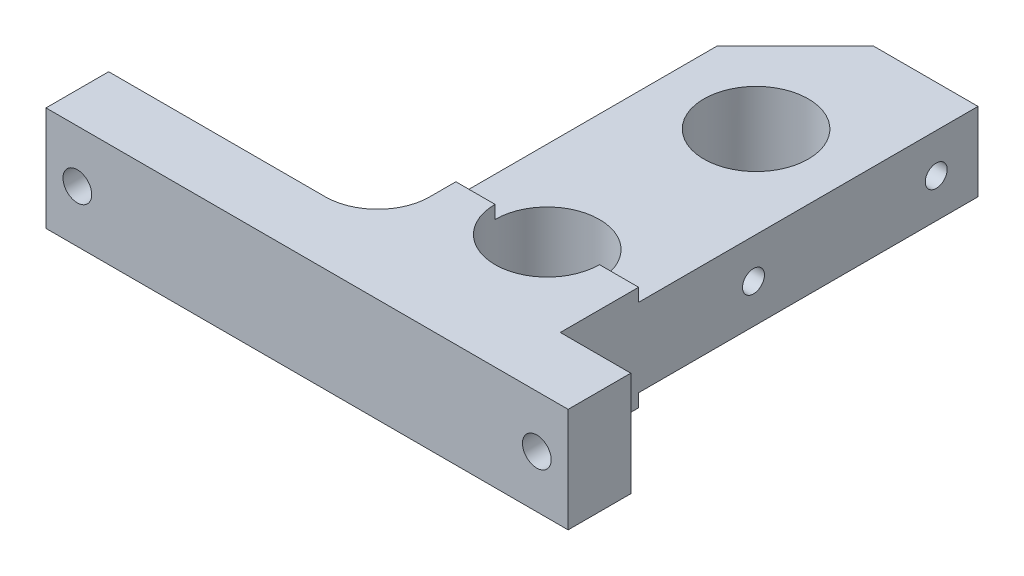
ISO-10303-21;
HEADER;
FILE_DESCRIPTION(('STEP AP214'),'2;1');
FILE_NAME('part.step','',(''),(''),'','','');
FILE_SCHEMA(('AUTOMOTIVE_DESIGN { 1 0 10303 214 1 1 1 1 }'));
ENDSEC;
DATA;
#1=APPLICATION_CONTEXT('core data for automotive mechanical design processes');
#2=APPLICATION_PROTOCOL_DEFINITION('international standard','automotive_design',2000,#1);
#3=PRODUCT_CONTEXT('',#1,'mechanical');
#4=PRODUCT('Part','Part','',(#3));
#5=PRODUCT_RELATED_PRODUCT_CATEGORY('part','',(#4));
#6=PRODUCT_DEFINITION_FORMATION('','',#4);
#7=PRODUCT_DEFINITION_CONTEXT('part definition',#1,'design');
#8=PRODUCT_DEFINITION('design','',#6,#7);
#9=PRODUCT_DEFINITION_SHAPE('','',#8);
#10=(LENGTH_UNIT() NAMED_UNIT(*) SI_UNIT(.MILLI.,.METRE.));
#11=(NAMED_UNIT(*) PLANE_ANGLE_UNIT() SI_UNIT($,.RADIAN.));
#12=(NAMED_UNIT(*) SI_UNIT($,.STERADIAN.) SOLID_ANGLE_UNIT());
#13=UNCERTAINTY_MEASURE_WITH_UNIT(LENGTH_MEASURE(1.E-05),#10,'distance_accuracy_value','');
#14=(GEOMETRIC_REPRESENTATION_CONTEXT(3) GLOBAL_UNCERTAINTY_ASSIGNED_CONTEXT((#13)) GLOBAL_UNIT_ASSIGNED_CONTEXT((#10,
#11,#12)) REPRESENTATION_CONTEXT('',''));
#15=CARTESIAN_POINT('',(0.,0.,0.));
#16=DIRECTION('',(0.,0.,1.));
#17=DIRECTION('',(1.,0.,0.));
#18=AXIS2_PLACEMENT_3D('',#15,#16,#17);
#19=CARTESIAN_POINT('',(0.,0.,-15.));
#20=DIRECTION('',(0.,0.,-1.));
#21=DIRECTION('',(-1.,0.,0.));
#22=AXIS2_PLACEMENT_3D('',#19,#20,#21);
#23=PLANE('',#22);
#24=DIRECTION('',(-1.,0.,0.));
#25=VECTOR('',#24,1.);
#26=CARTESIAN_POINT('',(1.50000000000001,-10.,-15.));
#27=LINE('',#26,#25);
#28=CARTESIAN_POINT('',(36.5,-10.,-15.));
#29=VERTEX_POINT('',#28);
#30=CARTESIAN_POINT('',(29.,-9.99999999999999,-15.));
#31=VERTEX_POINT('',#30);
#32=EDGE_CURVE('E238',#29,#31,#27,.T.);
#33=ORIENTED_EDGE('',*,*,#32,.T.);
#34=DIRECTION('',(0.,-1.,0.));
#35=VECTOR('',#34,1.);
#36=CARTESIAN_POINT('',(29.,72.5,-15.));
#37=LINE('',#36,#35);
#38=CARTESIAN_POINT('',(29.,-7.50000000000001,-15.));
#39=VERTEX_POINT('',#38);
#40=EDGE_CURVE('E193',#31,#39,#37,.F.);
#41=ORIENTED_EDGE('',*,*,#40,.T.);
#42=DIRECTION('',(-1.,0.,0.));
#43=VECTOR('',#42,1.);
#44=CARTESIAN_POINT('',(1.50000000000001,-7.5,-15.));
#45=LINE('',#44,#43);
#46=CARTESIAN_POINT('',(36.5,-7.50000000000001,-15.));
#47=VERTEX_POINT('',#46);
#48=EDGE_CURVE('E210',#47,#39,#45,.T.);
#49=ORIENTED_EDGE('',*,*,#48,.F.);
#50=DIRECTION('',(0.,-1.,0.));
#51=VECTOR('',#50,1.);
#52=CARTESIAN_POINT('',(36.5,-10.,-15.));
#53=LINE('',#52,#51);
#54=EDGE_CURVE('E237',#47,#29,#53,.T.);
#55=ORIENTED_EDGE('',*,*,#54,.T.);
#56=EDGE_LOOP('',(#33,#41,#49,#55));
#57=FACE_BOUND('',#56,.T.);
#58=ADVANCED_FACE('F35',(#57),#23,.T.);
#59=CARTESIAN_POINT('',(9.00000000000001,-7.50000000000001,-15.));
#60=VERTEX_POINT('',#59);
#61=CARTESIAN_POINT('',(1.50000000000001,-7.50000000000001,-15.));
#62=VERTEX_POINT('',#61);
#63=EDGE_CURVE('E219',#60,#62,#45,.T.);
#64=ORIENTED_EDGE('',*,*,#63,.F.);
#65=DIRECTION('',(0.,-1.,0.));
#66=VECTOR('',#65,1.);
#67=CARTESIAN_POINT('',(9.00000000000001,72.5,-15.));
#68=LINE('',#67,#66);
#69=CARTESIAN_POINT('',(9.00000000000001,-9.99999999999999,-15.));
#70=VERTEX_POINT('',#69);
#71=EDGE_CURVE('E59',#60,#70,#68,.T.);
#72=ORIENTED_EDGE('',*,*,#71,.T.);
#73=CARTESIAN_POINT('',(1.50000000000001,-10.,-15.));
#74=VERTEX_POINT('',#73);
#75=EDGE_CURVE('E236',#70,#74,#27,.T.);
#76=ORIENTED_EDGE('',*,*,#75,.T.);
#77=DIRECTION('',(0.,1.,0.));
#78=VECTOR('',#77,1.);
#79=CARTESIAN_POINT('',(1.50000000000001,-10.,-15.));
#80=LINE('',#79,#78);
#81=EDGE_CURVE('E242',#74,#62,#80,.T.);
#82=ORIENTED_EDGE('',*,*,#81,.T.);
#83=EDGE_LOOP('',(#64,#72,#76,#82));
#84=FACE_BOUND('',#83,.T.);
#85=ADVANCED_FACE('F379',(#84),#23,.T.);
#86=DIRECTION('',(1.,0.,0.));
#87=VECTOR('',#86,1.);
#88=CARTESIAN_POINT('',(1.50000000000001,7.5,-15.));
#89=LINE('',#88,#87);
#90=CARTESIAN_POINT('',(29.,7.50000000000001,-15.));
#91=VERTEX_POINT('',#90);
#92=CARTESIAN_POINT('',(36.5,7.5,-15.));
#93=VERTEX_POINT('',#92);
#94=EDGE_CURVE('E206',#91,#93,#89,.T.);
#95=ORIENTED_EDGE('',*,*,#94,.F.);
#96=DIRECTION('',(0.,-1.,0.));
#97=VECTOR('',#96,1.);
#98=CARTESIAN_POINT('',(29.,72.5,-15.));
#99=LINE('',#98,#97);
#100=CARTESIAN_POINT('',(29.,10.,-15.));
#101=VERTEX_POINT('',#100);
#102=EDGE_CURVE('E52',#91,#101,#99,.F.);
#103=ORIENTED_EDGE('',*,*,#102,.T.);
#104=DIRECTION('',(1.,0.,0.));
#105=VECTOR('',#104,1.);
#106=CARTESIAN_POINT('',(1.50000000000001,10.,-15.));
#107=LINE('',#106,#105);
#108=CARTESIAN_POINT('',(36.5,10.,-15.));
#109=VERTEX_POINT('',#108);
#110=EDGE_CURVE('E245',#101,#109,#107,.T.);
#111=ORIENTED_EDGE('',*,*,#110,.T.);
#112=EDGE_CURVE('E233',#109,#93,#53,.T.);
#113=ORIENTED_EDGE('',*,*,#112,.T.);
#114=EDGE_LOOP('',(#95,#103,#111,#113));
#115=FACE_BOUND('',#114,.T.);
#116=ADVANCED_FACE('F351',(#115),#23,.T.);
#117=CARTESIAN_POINT('',(1.50000000000001,10.,-15.));
#118=VERTEX_POINT('',#117);
#119=CARTESIAN_POINT('',(9.00000000000001,10.,-15.));
#120=VERTEX_POINT('',#119);
#121=EDGE_CURVE('E246',#118,#120,#107,.T.);
#122=ORIENTED_EDGE('',*,*,#121,.T.);
#123=DIRECTION('',(0.,-1.,0.));
#124=VECTOR('',#123,1.);
#125=CARTESIAN_POINT('',(9.00000000000001,72.5,-15.));
#126=LINE('',#125,#124);
#127=CARTESIAN_POINT('',(9.00000000000001,7.50000000000001,-15.));
#128=VERTEX_POINT('',#127);
#129=EDGE_CURVE('E200',#120,#128,#126,.T.);
#130=ORIENTED_EDGE('',*,*,#129,.T.);
#131=CARTESIAN_POINT('',(1.50000000000001,7.5,-15.));
#132=VERTEX_POINT('',#131);
#133=EDGE_CURVE('E216',#132,#128,#89,.T.);
#134=ORIENTED_EDGE('',*,*,#133,.F.);
#135=EDGE_CURVE('E241',#132,#118,#80,.T.);
#136=ORIENTED_EDGE('',*,*,#135,.T.);
#137=EDGE_LOOP('',(#122,#130,#134,#136));
#138=FACE_BOUND('',#137,.T.);
#139=ADVANCED_FACE('F334',(#138),#23,.T.);
#140=CARTESIAN_POINT('',(0.,0.,0.));
#141=DIRECTION('',(0.,0.,1.));
#142=DIRECTION('',(1.,0.,0.));
#143=AXIS2_PLACEMENT_3D('',#140,#141,#142);
#144=PLANE('',#143);
#145=CARTESIAN_POINT('',(44.,0.,0.));
#146=DIRECTION('',(0.,0.,-1.));
#147=DIRECTION('',(-1.,0.,0.));
#148=AXIS2_PLACEMENT_3D('',#145,#146,#147);
#149=CIRCLE('',#148,2.75);
#150=CARTESIAN_POINT('',(41.25,0.,0.));
#151=VERTEX_POINT('',#150);
#152=EDGE_CURVE('E323',#151,#151,#149,.T.);
#153=ORIENTED_EDGE('',*,*,#152,.F.);
#154=EDGE_LOOP('',(#153));
#155=FACE_BOUND('',#154,.T.);
#156=DIRECTION('',(0.,-1.,0.));
#157=VECTOR('',#156,1.);
#158=CARTESIAN_POINT('',(36.5,-10.,0.));
#159=LINE('',#158,#157);
#160=CARTESIAN_POINT('',(36.5,10.,0.));
#161=VERTEX_POINT('',#160);
#162=CARTESIAN_POINT('',(36.5,-10.,0.));
#163=VERTEX_POINT('',#162);
#164=EDGE_CURVE('E232',#161,#163,#159,.T.);
#165=ORIENTED_EDGE('',*,*,#164,.F.);
#166=DIRECTION('',(-1.,0.,0.));
#167=VECTOR('',#166,1.);
#168=CARTESIAN_POINT('',(-50.,10.,0.));
#169=LINE('',#168,#167);
#170=CARTESIAN_POINT('',(50.,10.,0.));
#171=VERTEX_POINT('',#170);
#172=EDGE_CURVE('E278',#171,#161,#169,.T.);
#173=ORIENTED_EDGE('',*,*,#172,.F.);
#174=DIRECTION('',(0.,1.,0.));
#175=VECTOR('',#174,1.);
#176=CARTESIAN_POINT('',(50.,10.,0.));
#177=LINE('',#176,#175);
#178=CARTESIAN_POINT('',(50.,-10.,0.));
#179=VERTEX_POINT('',#178);
#180=EDGE_CURVE('E263',#179,#171,#177,.T.);
#181=ORIENTED_EDGE('',*,*,#180,.F.);
#182=DIRECTION('',(1.,0.,0.));
#183=VECTOR('',#182,1.);
#184=CARTESIAN_POINT('',(-50.,-10.,0.));
#185=LINE('',#184,#183);
#186=EDGE_CURVE('E283',#163,#179,#185,.T.);
#187=ORIENTED_EDGE('',*,*,#186,.F.);
#188=EDGE_LOOP('',(#165,#173,#181,#187));
#189=FACE_BOUND('',#188,.T.);
#190=ADVANCED_FACE('F330',(#155,#189),#144,.F.);
#191=CARTESIAN_POINT('',(-44.,0.,0.));
#192=DIRECTION('',(0.,0.,-1.));
#193=DIRECTION('',(-1.,0.,0.));
#194=AXIS2_PLACEMENT_3D('',#191,#192,#193);
#195=CIRCLE('',#194,2.75);
#196=CARTESIAN_POINT('',(-46.75,0.,0.));
#197=VERTEX_POINT('',#196);
#198=EDGE_CURVE('E316',#197,#197,#195,.T.);
#199=ORIENTED_EDGE('',*,*,#198,.F.);
#200=EDGE_LOOP('',(#199));
#201=FACE_BOUND('',#200,.T.);
#202=CARTESIAN_POINT('',(-8.50000000000001,10.,0.));
#203=VERTEX_POINT('',#202);
#204=CARTESIAN_POINT('',(-50.,10.,0.));
#205=VERTEX_POINT('',#204);
#206=EDGE_CURVE('E277',#203,#205,#169,.T.);
#207=ORIENTED_EDGE('',*,*,#206,.F.);
#208=DIRECTION('',(0.,1.,0.));
#209=VECTOR('',#208,1.);
#210=CARTESIAN_POINT('',(-8.49999999999999,-10.,0.));
#211=LINE('',#210,#209);
#212=CARTESIAN_POINT('',(-8.49999999999999,-10.,0.));
#213=VERTEX_POINT('',#212);
#214=EDGE_CURVE('E300',#203,#213,#211,.F.);
#215=ORIENTED_EDGE('',*,*,#214,.T.);
#216=CARTESIAN_POINT('',(-50.,-10.,0.));
#217=VERTEX_POINT('',#216);
#218=EDGE_CURVE('E268',#217,#213,#185,.T.);
#219=ORIENTED_EDGE('',*,*,#218,.F.);
#220=DIRECTION('',(0.,-1.,0.));
#221=VECTOR('',#220,1.);
#222=CARTESIAN_POINT('',(-50.,10.,0.));
#223=LINE('',#222,#221);
#224=EDGE_CURVE('E281',#205,#217,#223,.T.);
#225=ORIENTED_EDGE('',*,*,#224,.F.);
#226=EDGE_LOOP('',(#207,#215,#219,#225));
#227=FACE_BOUND('',#226,.T.);
#228=ADVANCED_FACE('F333',(#201,#227),#144,.F.);
#229=CARTESIAN_POINT('',(50.,10.,12.));
#230=DIRECTION('',(-1.,0.,0.));
#231=DIRECTION('',(0.,0.,1.));
#232=AXIS2_PLACEMENT_3D('',#229,#230,#231);
#233=PLANE('',#232);
#234=ORIENTED_EDGE('',*,*,#180,.T.);
#235=DIRECTION('',(0.,0.,-1.));
#236=VECTOR('',#235,1.);
#237=CARTESIAN_POINT('',(50.,10.,12.));
#238=LINE('',#237,#236);
#239=CARTESIAN_POINT('',(50.,10.,12.));
#240=VERTEX_POINT('',#239);
#241=EDGE_CURVE('E294',#240,#171,#238,.T.);
#242=ORIENTED_EDGE('',*,*,#241,.F.);
#243=DIRECTION('',(0.,1.,0.));
#244=VECTOR('',#243,1.);
#245=CARTESIAN_POINT('',(50.,10.,12.));
#246=LINE('',#245,#244);
#247=CARTESIAN_POINT('',(50.,-10.,12.));
#248=VERTEX_POINT('',#247);
#249=EDGE_CURVE('E264',#248,#240,#246,.T.);
#250=ORIENTED_EDGE('',*,*,#249,.F.);
#251=DIRECTION('',(0.,0.,-1.));
#252=VECTOR('',#251,1.);
#253=CARTESIAN_POINT('',(50.,-10.,12.));
#254=LINE('',#253,#252);
#255=EDGE_CURVE('E274',#248,#179,#254,.T.);
#256=ORIENTED_EDGE('',*,*,#255,.T.);
#257=EDGE_LOOP('',(#234,#242,#250,#256));
#258=FACE_BOUND('',#257,.T.);
#259=ADVANCED_FACE('F484',(#258),#233,.F.);
#260=CARTESIAN_POINT('',(-50.,10.,12.));
#261=DIRECTION('',(0.,-1.,0.));
#262=DIRECTION('',(0.,0.,-1.));
#263=AXIS2_PLACEMENT_3D('',#260,#261,#262);
#264=PLANE('',#263);
#265=CARTESIAN_POINT('',(19.,10.,-15.));
#266=DIRECTION('',(0.,-1.,0.));
#267=DIRECTION('',(0.,0.,-1.));
#268=AXIS2_PLACEMENT_3D('',#265,#266,#267);
#269=CIRCLE('',#268,10.);
#270=EDGE_CURVE('E204',#120,#101,#269,.F.);
#271=ORIENTED_EDGE('',*,*,#270,.F.);
#272=ORIENTED_EDGE('',*,*,#121,.F.);
#273=DIRECTION('',(0.,0.,1.));
#274=VECTOR('',#273,1.);
#275=CARTESIAN_POINT('',(1.50000000000001,10.,-15.));
#276=LINE('',#275,#274);
#277=CARTESIAN_POINT('',(1.50000000000001,10.,-10.));
#278=VERTEX_POINT('',#277);
#279=EDGE_CURVE('E254',#118,#278,#276,.T.);
#280=ORIENTED_EDGE('',*,*,#279,.T.);
#281=CARTESIAN_POINT('',(-8.49999999999999,10.,-10.));
#282=DIRECTION('',(0.,-1.,0.));
#283=DIRECTION('',(0.,0.,-1.));
#284=AXIS2_PLACEMENT_3D('',#281,#282,#283);
#285=CIRCLE('',#284,10.);
#286=EDGE_CURVE('E302',#278,#203,#285,.T.);
#287=ORIENTED_EDGE('',*,*,#286,.T.);
#288=ORIENTED_EDGE('',*,*,#206,.T.);
#289=DIRECTION('',(0.,0.,-1.));
#290=VECTOR('',#289,1.);
#291=CARTESIAN_POINT('',(-50.,10.,12.));
#292=LINE('',#291,#290);
#293=CARTESIAN_POINT('',(-50.,10.,12.));
#294=VERTEX_POINT('',#293);
#295=EDGE_CURVE('E291',#294,#205,#292,.T.);
#296=ORIENTED_EDGE('',*,*,#295,.F.);
#297=DIRECTION('',(-1.,0.,0.));
#298=VECTOR('',#297,1.);
#299=CARTESIAN_POINT('',(-50.,10.,12.));
#300=LINE('',#299,#298);
#301=EDGE_CURVE('E267',#240,#294,#300,.T.);
#302=ORIENTED_EDGE('',*,*,#301,.F.);
#303=ORIENTED_EDGE('',*,*,#241,.T.);
#304=ORIENTED_EDGE('',*,*,#172,.T.);
#305=DIRECTION('',(0.,0.,1.));
#306=VECTOR('',#305,1.);
#307=CARTESIAN_POINT('',(36.5,10.,-15.));
#308=LINE('',#307,#306);
#309=EDGE_CURVE('E249',#109,#161,#308,.T.);
#310=ORIENTED_EDGE('',*,*,#309,.F.);
#311=ORIENTED_EDGE('',*,*,#110,.F.);
#312=EDGE_LOOP('',(#271,#272,#280,#287,#288,#296,#302,#303,#304,#310,#311));
#313=FACE_BOUND('',#312,.T.);
#314=ADVANCED_FACE('F342',(#313),#264,.F.);
#315=CARTESIAN_POINT('',(-50.,10.,12.));
#316=DIRECTION('',(1.,0.,0.));
#317=DIRECTION('',(0.,1.,0.));
#318=AXIS2_PLACEMENT_3D('',#315,#316,#317);
#319=PLANE('',#318);
#320=ORIENTED_EDGE('',*,*,#224,.T.);
#321=DIRECTION('',(0.,0.,-1.));
#322=VECTOR('',#321,1.);
#323=CARTESIAN_POINT('',(-50.,-10.,12.));
#324=LINE('',#323,#322);
#325=CARTESIAN_POINT('',(-50.,-10.,12.));
#326=VERTEX_POINT('',#325);
#327=EDGE_CURVE('E288',#326,#217,#324,.T.);
#328=ORIENTED_EDGE('',*,*,#327,.F.);
#329=DIRECTION('',(0.,-1.,0.));
#330=VECTOR('',#329,1.);
#331=CARTESIAN_POINT('',(-50.,10.,12.));
#332=LINE('',#331,#330);
#333=EDGE_CURVE('E270',#294,#326,#332,.T.);
#334=ORIENTED_EDGE('',*,*,#333,.F.);
#335=ORIENTED_EDGE('',*,*,#295,.T.);
#336=EDGE_LOOP('',(#320,#328,#334,#335));
#337=FACE_BOUND('',#336,.T.);
#338=ADVANCED_FACE('F470',(#337),#319,.F.);
#339=CARTESIAN_POINT('',(-50.,-10.,12.));
#340=DIRECTION('',(0.,1.,0.));
#341=DIRECTION('',(0.,0.,1.));
#342=AXIS2_PLACEMENT_3D('',#339,#340,#341);
#343=PLANE('',#342);
#344=CARTESIAN_POINT('',(19.,-9.99999999999999,-15.));
#345=DIRECTION('',(0.,1.,0.));
#346=DIRECTION('',(0.,0.,1.));
#347=AXIS2_PLACEMENT_3D('',#344,#345,#346);
#348=CIRCLE('',#347,10.);
#349=EDGE_CURVE('E196',#31,#70,#348,.F.);
#350=ORIENTED_EDGE('',*,*,#349,.F.);
#351=ORIENTED_EDGE('',*,*,#32,.F.);
#352=DIRECTION('',(0.,0.,1.));
#353=VECTOR('',#352,1.);
#354=CARTESIAN_POINT('',(36.5,-10.,-15.));
#355=LINE('',#354,#353);
#356=EDGE_CURVE('E260',#29,#163,#355,.T.);
#357=ORIENTED_EDGE('',*,*,#356,.T.);
#358=ORIENTED_EDGE('',*,*,#186,.T.);
#359=ORIENTED_EDGE('',*,*,#255,.F.);
#360=DIRECTION('',(1.,0.,0.));
#361=VECTOR('',#360,1.);
#362=CARTESIAN_POINT('',(-50.,-10.,12.));
#363=LINE('',#362,#361);
#364=EDGE_CURVE('E272',#326,#248,#363,.T.);
#365=ORIENTED_EDGE('',*,*,#364,.F.);
#366=ORIENTED_EDGE('',*,*,#327,.T.);
#367=ORIENTED_EDGE('',*,*,#218,.T.);
#368=CARTESIAN_POINT('',(-8.49999999999999,-10.,-10.));
#369=DIRECTION('',(0.,1.,0.));
#370=DIRECTION('',(0.,0.,1.));
#371=AXIS2_PLACEMENT_3D('',#368,#369,#370);
#372=CIRCLE('',#371,10.);
#373=CARTESIAN_POINT('',(1.50000000000001,-10.,-10.));
#374=VERTEX_POINT('',#373);
#375=EDGE_CURVE('E304',#213,#374,#372,.T.);
#376=ORIENTED_EDGE('',*,*,#375,.T.);
#377=DIRECTION('',(0.,0.,1.));
#378=VECTOR('',#377,1.);
#379=CARTESIAN_POINT('',(1.50000000000001,-10.,-15.));
#380=LINE('',#379,#378);
#381=EDGE_CURVE('E257',#74,#374,#380,.T.);
#382=ORIENTED_EDGE('',*,*,#381,.F.);
#383=ORIENTED_EDGE('',*,*,#75,.F.);
#384=EDGE_LOOP('',(#350,#351,#357,#358,#359,#365,#366,#367,#376,#382,#383));
#385=FACE_BOUND('',#384,.T.);
#386=ADVANCED_FACE('F373',(#385),#343,.F.);
#387=CARTESIAN_POINT('',(0.,0.,12.));
#388=DIRECTION('',(0.,0.,1.));
#389=DIRECTION('',(1.,0.,0.));
#390=AXIS2_PLACEMENT_3D('',#387,#388,#389);
#391=PLANE('',#390);
#392=CARTESIAN_POINT('',(44.,0.,12.));
#393=DIRECTION('',(0.,0.,1.));
#394=DIRECTION('',(1.,0.,0.));
#395=AXIS2_PLACEMENT_3D('',#392,#393,#394);
#396=CIRCLE('',#395,2.75);
#397=CARTESIAN_POINT('',(46.75,0.,12.));
#398=VERTEX_POINT('',#397);
#399=EDGE_CURVE('E39',#398,#398,#396,.T.);
#400=ORIENTED_EDGE('',*,*,#399,.F.);
#401=EDGE_LOOP('',(#400));
#402=FACE_BOUND('',#401,.T.);
#403=CARTESIAN_POINT('',(-44.,0.,12.));
#404=DIRECTION('',(0.,0.,1.));
#405=DIRECTION('',(1.,0.,0.));
#406=AXIS2_PLACEMENT_3D('',#403,#404,#405);
#407=CIRCLE('',#406,2.75);
#408=CARTESIAN_POINT('',(-41.25,0.,12.));
#409=VERTEX_POINT('',#408);
#410=EDGE_CURVE('E182',#409,#409,#407,.T.);
#411=ORIENTED_EDGE('',*,*,#410,.F.);
#412=EDGE_LOOP('',(#411));
#413=FACE_BOUND('',#412,.T.);
#414=ORIENTED_EDGE('',*,*,#249,.T.);
#415=ORIENTED_EDGE('',*,*,#301,.T.);
#416=ORIENTED_EDGE('',*,*,#333,.T.);
#417=ORIENTED_EDGE('',*,*,#364,.T.);
#418=EDGE_LOOP('',(#414,#415,#416,#417));
#419=FACE_BOUND('',#418,.T.);
#420=ADVANCED_FACE('F509',(#402,#413,#419),#391,.T.);
#421=CARTESIAN_POINT('',(36.5,-10.,-15.));
#422=DIRECTION('',(-1.,0.,0.));
#423=DIRECTION('',(0.,0.,1.));
#424=AXIS2_PLACEMENT_3D('',#421,#422,#423);
#425=PLANE('',#424);
#426=CARTESIAN_POINT('',(36.5,0.,-72.));
#427=DIRECTION('',(1.,0.,0.));
#428=DIRECTION('',(0.,0.,-1.));
#429=AXIS2_PLACEMENT_3D('',#426,#427,#428);
#430=CIRCLE('',#429,2.1);
#431=CARTESIAN_POINT('',(36.5,0.,-74.1));
#432=VERTEX_POINT('',#431);
#433=EDGE_CURVE('E176',#432,#432,#430,.T.);
#434=ORIENTED_EDGE('',*,*,#433,.F.);
#435=EDGE_LOOP('',(#434));
#436=FACE_BOUND('',#435,.T.);
#437=CARTESIAN_POINT('',(36.5,0.,-37.));
#438=DIRECTION('',(1.,0.,0.));
#439=DIRECTION('',(0.,0.,-1.));
#440=AXIS2_PLACEMENT_3D('',#437,#438,#439);
#441=CIRCLE('',#440,2.1);
#442=CARTESIAN_POINT('',(36.5,0.,-39.1));
#443=VERTEX_POINT('',#442);
#444=EDGE_CURVE('E175',#443,#443,#441,.T.);
#445=ORIENTED_EDGE('',*,*,#444,.F.);
#446=EDGE_LOOP('',(#445));
#447=FACE_BOUND('',#446,.T.);
#448=ORIENTED_EDGE('',*,*,#164,.T.);
#449=ORIENTED_EDGE('',*,*,#356,.F.);
#450=ORIENTED_EDGE('',*,*,#54,.F.);
#451=DIRECTION('',(0.,0.,1.));
#452=VECTOR('',#451,1.);
#453=CARTESIAN_POINT('',(36.5,-7.50000000000001,-80.));
#454=LINE('',#453,#452);
#455=CARTESIAN_POINT('',(36.5,-7.50000000000001,-80.));
#456=VERTEX_POINT('',#455);
#457=EDGE_CURVE('E224',#456,#47,#454,.T.);
#458=ORIENTED_EDGE('',*,*,#457,.F.);
#459=DIRECTION('',(0.,-1.,0.));
#460=VECTOR('',#459,1.);
#461=CARTESIAN_POINT('',(36.5,-7.50000000000001,-80.));
#462=LINE('',#461,#460);
#463=CARTESIAN_POINT('',(36.5,7.5,-80.));
#464=VERTEX_POINT('',#463);
#465=EDGE_CURVE('E209',#464,#456,#462,.T.);
#466=ORIENTED_EDGE('',*,*,#465,.F.);
#467=DIRECTION('',(0.,0.,1.));
#468=VECTOR('',#467,1.);
#469=CARTESIAN_POINT('',(36.5,7.5,-80.));
#470=LINE('',#469,#468);
#471=EDGE_CURVE('E227',#464,#93,#470,.T.);
#472=ORIENTED_EDGE('',*,*,#471,.T.);
#473=ORIENTED_EDGE('',*,*,#112,.F.);
#474=ORIENTED_EDGE('',*,*,#309,.T.);
#475=EDGE_LOOP('',(#448,#449,#450,#458,#466,#472,#473,#474));
#476=FACE_BOUND('',#475,.T.);
#477=ADVANCED_FACE('F346',(#436,#447,#476),#425,.F.);
#478=CARTESIAN_POINT('',(1.50000000000001,-10.,-15.));
#479=DIRECTION('',(1.,0.,0.));
#480=DIRECTION('',(0.,0.,-1.));
#481=AXIS2_PLACEMENT_3D('',#478,#479,#480);
#482=PLANE('',#481);
#483=DIRECTION('',(0.,0.,1.));
#484=VECTOR('',#483,1.);
#485=CARTESIAN_POINT('',(1.50000000000001,7.5,-80.));
#486=LINE('',#485,#484);
#487=CARTESIAN_POINT('',(1.50000000000001,7.5,-65.));
#488=VERTEX_POINT('',#487);
#489=EDGE_CURVE('E230',#488,#132,#486,.T.);
#490=ORIENTED_EDGE('',*,*,#489,.F.);
#491=DIRECTION('',(0.,-1.,0.));
#492=VECTOR('',#491,1.);
#493=CARTESIAN_POINT('',(1.50000000000001,-7.5,-65.));
#494=LINE('',#493,#492);
#495=CARTESIAN_POINT('',(1.50000000000001,-7.5,-65.));
#496=VERTEX_POINT('',#495);
#497=EDGE_CURVE('E311',#488,#496,#494,.T.);
#498=ORIENTED_EDGE('',*,*,#497,.T.);
#499=DIRECTION('',(0.,0.,1.));
#500=VECTOR('',#499,1.);
#501=CARTESIAN_POINT('',(1.50000000000001,-7.5,-80.));
#502=LINE('',#501,#500);
#503=EDGE_CURVE('E215',#496,#62,#502,.T.);
#504=ORIENTED_EDGE('',*,*,#503,.T.);
#505=ORIENTED_EDGE('',*,*,#81,.F.);
#506=ORIENTED_EDGE('',*,*,#381,.T.);
#507=DIRECTION('',(0.,1.,0.));
#508=VECTOR('',#507,1.);
#509=CARTESIAN_POINT('',(1.50000000000001,10.,-10.));
#510=LINE('',#509,#508);
#511=EDGE_CURVE('E297',#374,#278,#510,.T.);
#512=ORIENTED_EDGE('',*,*,#511,.T.);
#513=ORIENTED_EDGE('',*,*,#279,.F.);
#514=ORIENTED_EDGE('',*,*,#135,.F.);
#515=EDGE_LOOP('',(#490,#498,#504,#505,#506,#512,#513,#514));
#516=FACE_BOUND('',#515,.T.);
#517=ADVANCED_FACE('F359',(#516),#482,.F.);
#518=CARTESIAN_POINT('',(1.50000000000001,7.5,-80.));
#519=DIRECTION('',(0.,-1.,0.));
#520=DIRECTION('',(1.,0.,0.));
#521=AXIS2_PLACEMENT_3D('',#518,#519,#520);
#522=PLANE('',#521);
#523=CARTESIAN_POINT('',(19.,7.50000000000001,-55.));
#524=DIRECTION('',(0.,-1.,0.));
#525=DIRECTION('',(1.,0.,0.));
#526=AXIS2_PLACEMENT_3D('',#523,#524,#525);
#527=CIRCLE('',#526,10.);
#528=CARTESIAN_POINT('',(29.,7.50000000000001,-55.));
#529=VERTEX_POINT('',#528);
#530=EDGE_CURVE('E189',#529,#529,#527,.F.);
#531=ORIENTED_EDGE('',*,*,#530,.F.);
#532=EDGE_LOOP('',(#531));
#533=FACE_BOUND('',#532,.T.);
#534=CARTESIAN_POINT('',(19.,7.50000000000001,-15.));
#535=DIRECTION('',(0.,-1.,0.));
#536=DIRECTION('',(1.,0.,0.));
#537=AXIS2_PLACEMENT_3D('',#534,#535,#536);
#538=CIRCLE('',#537,10.);
#539=EDGE_CURVE('E198',#91,#128,#538,.F.);
#540=ORIENTED_EDGE('',*,*,#539,.F.);
#541=ORIENTED_EDGE('',*,*,#94,.T.);
#542=ORIENTED_EDGE('',*,*,#471,.F.);
#543=DIRECTION('',(1.,0.,0.));
#544=VECTOR('',#543,1.);
#545=CARTESIAN_POINT('',(1.50000000000001,7.5,-80.));
#546=LINE('',#545,#544);
#547=CARTESIAN_POINT('',(16.5,7.5,-80.));
#548=VERTEX_POINT('',#547);
#549=EDGE_CURVE('E207',#548,#464,#546,.T.);
#550=ORIENTED_EDGE('',*,*,#549,.F.);
#551=DIRECTION('',(-0.707106781186547,0.,0.707106781186548));
#552=VECTOR('',#551,1.);
#553=CARTESIAN_POINT('',(16.5,7.5,-80.));
#554=LINE('',#553,#552);
#555=EDGE_CURVE('E309',#548,#488,#554,.T.);
#556=ORIENTED_EDGE('',*,*,#555,.T.);
#557=ORIENTED_EDGE('',*,*,#489,.T.);
#558=ORIENTED_EDGE('',*,*,#133,.T.);
#559=EDGE_LOOP('',(#540,#541,#542,#550,#556,#557,#558));
#560=FACE_BOUND('',#559,.T.);
#561=ADVANCED_FACE('F395',(#533,#560),#522,.F.);
#562=CARTESIAN_POINT('',(1.50000000000001,-7.5,-80.));
#563=DIRECTION('',(0.,1.,0.));
#564=DIRECTION('',(-1.,0.,0.));
#565=AXIS2_PLACEMENT_3D('',#562,#563,#564);
#566=PLANE('',#565);
#567=CARTESIAN_POINT('',(19.,-7.50000000000001,-55.));
#568=DIRECTION('',(0.,1.,0.));
#569=DIRECTION('',(-1.,0.,0.));
#570=AXIS2_PLACEMENT_3D('',#567,#568,#569);
#571=CIRCLE('',#570,10.);
#572=CARTESIAN_POINT('',(9.00000000000001,-7.50000000000001,-55.));
#573=VERTEX_POINT('',#572);
#574=EDGE_CURVE('E188',#573,#573,#571,.F.);
#575=ORIENTED_EDGE('',*,*,#574,.F.);
#576=EDGE_LOOP('',(#575));
#577=FACE_BOUND('',#576,.T.);
#578=CARTESIAN_POINT('',(19.,-7.50000000000001,-15.));
#579=DIRECTION('',(0.,1.,0.));
#580=DIRECTION('',(-1.,0.,0.));
#581=AXIS2_PLACEMENT_3D('',#578,#579,#580);
#582=CIRCLE('',#581,10.);
#583=EDGE_CURVE('E11',#60,#39,#582,.F.);
#584=ORIENTED_EDGE('',*,*,#583,.F.);
#585=ORIENTED_EDGE('',*,*,#63,.T.);
#586=ORIENTED_EDGE('',*,*,#503,.F.);
#587=DIRECTION('',(0.707106781186547,0.,-0.707106781186548));
#588=VECTOR('',#587,1.);
#589=CARTESIAN_POINT('',(16.5,-7.50000000000001,-80.));
#590=LINE('',#589,#588);
#591=CARTESIAN_POINT('',(16.5,-7.50000000000001,-80.));
#592=VERTEX_POINT('',#591);
#593=EDGE_CURVE('E44',#496,#592,#590,.T.);
#594=ORIENTED_EDGE('',*,*,#593,.T.);
#595=DIRECTION('',(-1.,0.,0.));
#596=VECTOR('',#595,1.);
#597=CARTESIAN_POINT('',(1.50000000000001,-7.5,-80.));
#598=LINE('',#597,#596);
#599=EDGE_CURVE('E212',#456,#592,#598,.T.);
#600=ORIENTED_EDGE('',*,*,#599,.F.);
#601=ORIENTED_EDGE('',*,*,#457,.T.);
#602=ORIENTED_EDGE('',*,*,#48,.T.);
#603=EDGE_LOOP('',(#584,#585,#586,#594,#600,#601,#602));
#604=FACE_BOUND('',#603,.T.);
#605=ADVANCED_FACE('F386',(#577,#604),#566,.F.);
#606=CARTESIAN_POINT('',(0.,0.,-80.));
#607=DIRECTION('',(0.,0.,-1.));
#608=DIRECTION('',(-1.,0.,0.));
#609=AXIS2_PLACEMENT_3D('',#606,#607,#608);
#610=PLANE('',#609);
#611=ORIENTED_EDGE('',*,*,#599,.T.);
#612=DIRECTION('',(0.,1.,0.));
#613=VECTOR('',#612,1.);
#614=CARTESIAN_POINT('',(16.5,7.5,-80.));
#615=LINE('',#614,#613);
#616=EDGE_CURVE('E306',#592,#548,#615,.T.);
#617=ORIENTED_EDGE('',*,*,#616,.T.);
#618=ORIENTED_EDGE('',*,*,#549,.T.);
#619=ORIENTED_EDGE('',*,*,#465,.T.);
#620=EDGE_LOOP('',(#611,#617,#618,#619));
#621=FACE_BOUND('',#620,.T.);
#622=ADVANCED_FACE('F390',(#621),#610,.T.);
#623=CARTESIAN_POINT('',(-8.49999999999999,-10.,-10.));
#624=DIRECTION('',(0.,-1.,0.));
#625=DIRECTION('',(0.,0.,-1.));
#626=AXIS2_PLACEMENT_3D('',#623,#624,#625);
#627=CYLINDRICAL_SURFACE('',#626,10.);
#628=ORIENTED_EDGE('',*,*,#375,.F.);
#629=ORIENTED_EDGE('',*,*,#214,.F.);
#630=ORIENTED_EDGE('',*,*,#286,.F.);
#631=ORIENTED_EDGE('',*,*,#511,.F.);
#632=EDGE_LOOP('',(#628,#629,#630,#631));
#633=FACE_BOUND('',#632,.T.);
#634=ADVANCED_FACE('F369',(#633),#627,.F.);
#635=CARTESIAN_POINT('',(16.5,0.,-80.));
#636=DIRECTION('',(-0.707106781186548,0.,-0.707106781186547));
#637=DIRECTION('',(0.,-1.,0.));
#638=AXIS2_PLACEMENT_3D('',#635,#636,#637);
#639=PLANE('',#638);
#640=ORIENTED_EDGE('',*,*,#593,.F.);
#641=ORIENTED_EDGE('',*,*,#497,.F.);
#642=ORIENTED_EDGE('',*,*,#555,.F.);
#643=ORIENTED_EDGE('',*,*,#616,.F.);
#644=EDGE_LOOP('',(#640,#641,#642,#643));
#645=FACE_BOUND('',#644,.T.);
#646=ADVANCED_FACE('F37',(#645),#639,.T.);
#647=CARTESIAN_POINT('',(19.,72.5,-15.));
#648=DIRECTION('',(0.,-1.,0.));
#649=DIRECTION('',(1.,0.,0.));
#650=AXIS2_PLACEMENT_3D('',#647,#648,#649);
#651=CYLINDRICAL_SURFACE('',#650,10.);
#652=ORIENTED_EDGE('',*,*,#349,.T.);
#653=ORIENTED_EDGE('',*,*,#71,.F.);
#654=ORIENTED_EDGE('',*,*,#583,.T.);
#655=ORIENTED_EDGE('',*,*,#40,.F.);
#656=EDGE_LOOP('',(#652,#653,#654,#655));
#657=FACE_BOUND('',#656,.T.);
#658=ORIENTED_EDGE('',*,*,#270,.T.);
#659=ORIENTED_EDGE('',*,*,#102,.F.);
#660=ORIENTED_EDGE('',*,*,#539,.T.);
#661=ORIENTED_EDGE('',*,*,#129,.F.);
#662=EDGE_LOOP('',(#658,#659,#660,#661));
#663=FACE_BOUND('',#662,.T.);
#664=ADVANCED_FACE('F396',(#657,#663),#651,.F.);
#665=CARTESIAN_POINT('',(19.,72.5,-55.));
#666=DIRECTION('',(0.,-1.,0.));
#667=DIRECTION('',(1.,0.,0.));
#668=AXIS2_PLACEMENT_3D('',#665,#666,#667);
#669=CYLINDRICAL_SURFACE('',#668,10.);
#670=ORIENTED_EDGE('',*,*,#574,.T.);
#671=EDGE_LOOP('',(#670));
#672=FACE_BOUND('',#671,.T.);
#673=ORIENTED_EDGE('',*,*,#530,.T.);
#674=EDGE_LOOP('',(#673));
#675=FACE_BOUND('',#674,.T.);
#676=ADVANCED_FACE('F398',(#672,#675),#669,.F.);
#677=CARTESIAN_POINT('',(26.5,0.,-37.));
#678=DIRECTION('',(1.,0.,0.));
#679=DIRECTION('',(0.,0.,-1.));
#680=AXIS2_PLACEMENT_3D('',#677,#678,#679);
#681=CONICAL_SURFACE('',#680,2.1,1.02974425867665);
#682=CARTESIAN_POINT('',(25.2381927000421,0.,-37.));
#683=VERTEX_POINT('',#682);
#684=VERTEX_LOOP('',#683);
#685=FACE_BOUND('',#684,.T.);
#686=CARTESIAN_POINT('',(26.5,0.,-37.));
#687=DIRECTION('',(1.,0.,0.));
#688=DIRECTION('',(0.,0.,-1.));
#689=AXIS2_PLACEMENT_3D('',#686,#687,#688);
#690=CIRCLE('',#689,2.1);
#691=CARTESIAN_POINT('',(26.5,0.,-39.1));
#692=VERTEX_POINT('',#691);
#693=EDGE_CURVE('E179',#692,#692,#690,.T.);
#694=ORIENTED_EDGE('',*,*,#693,.T.);
#695=EDGE_LOOP('',(#694));
#696=FACE_BOUND('',#695,.T.);
#697=ADVANCED_FACE('F404',(#685,#696),#681,.F.);
#698=CARTESIAN_POINT('',(36.5,0.,-37.));
#699=DIRECTION('',(1.,0.,0.));
#700=DIRECTION('',(0.,0.,-1.));
#701=AXIS2_PLACEMENT_3D('',#698,#699,#700);
#702=CYLINDRICAL_SURFACE('',#701,2.1);
#703=ORIENTED_EDGE('',*,*,#693,.F.);
#704=EDGE_LOOP('',(#703));
#705=FACE_BOUND('',#704,.T.);
#706=ORIENTED_EDGE('',*,*,#444,.T.);
#707=EDGE_LOOP('',(#706));
#708=FACE_BOUND('',#707,.T.);
#709=ADVANCED_FACE('F169',(#705,#708),#702,.F.);
#710=CARTESIAN_POINT('',(26.5,0.,-72.));
#711=DIRECTION('',(1.,0.,0.));
#712=DIRECTION('',(0.,0.,-1.));
#713=AXIS2_PLACEMENT_3D('',#710,#711,#712);
#714=CONICAL_SURFACE('',#713,2.1,1.02974425867665);
#715=CARTESIAN_POINT('',(25.2381927000421,0.,-72.));
#716=VERTEX_POINT('',#715);
#717=VERTEX_LOOP('',#716);
#718=FACE_BOUND('',#717,.T.);
#719=CARTESIAN_POINT('',(26.5,0.,-72.));
#720=DIRECTION('',(1.,0.,0.));
#721=DIRECTION('',(0.,0.,-1.));
#722=AXIS2_PLACEMENT_3D('',#719,#720,#721);
#723=CIRCLE('',#722,2.1);
#724=CARTESIAN_POINT('',(26.5,0.,-74.1));
#725=VERTEX_POINT('',#724);
#726=EDGE_CURVE('E173',#725,#725,#723,.T.);
#727=ORIENTED_EDGE('',*,*,#726,.T.);
#728=EDGE_LOOP('',(#727));
#729=FACE_BOUND('',#728,.T.);
#730=ADVANCED_FACE('F165',(#718,#729),#714,.F.);
#731=CARTESIAN_POINT('',(36.5,0.,-72.));
#732=DIRECTION('',(1.,0.,0.));
#733=DIRECTION('',(0.,0.,-1.));
#734=AXIS2_PLACEMENT_3D('',#731,#732,#733);
#735=CYLINDRICAL_SURFACE('',#734,2.1);
#736=ORIENTED_EDGE('',*,*,#726,.F.);
#737=EDGE_LOOP('',(#736));
#738=FACE_BOUND('',#737,.T.);
#739=ORIENTED_EDGE('',*,*,#433,.T.);
#740=EDGE_LOOP('',(#739));
#741=FACE_BOUND('',#740,.T.);
#742=ADVANCED_FACE('F168',(#738,#741),#735,.F.);
#743=CARTESIAN_POINT('',(-44.,0.,65.));
#744=DIRECTION('',(0.,0.,-1.));
#745=DIRECTION('',(-1.,0.,0.));
#746=AXIS2_PLACEMENT_3D('',#743,#744,#745);
#747=CYLINDRICAL_SURFACE('',#746,2.75);
#748=ORIENTED_EDGE('',*,*,#410,.T.);
#749=EDGE_LOOP('',(#748));
#750=FACE_BOUND('',#749,.T.);
#751=ORIENTED_EDGE('',*,*,#198,.T.);
#752=EDGE_LOOP('',(#751));
#753=FACE_BOUND('',#752,.T.);
#754=ADVANCED_FACE('F575',(#750,#753),#747,.F.);
#755=CARTESIAN_POINT('',(44.,0.,65.));
#756=DIRECTION('',(0.,0.,-1.));
#757=DIRECTION('',(-1.,0.,0.));
#758=AXIS2_PLACEMENT_3D('',#755,#756,#757);
#759=CYLINDRICAL_SURFACE('',#758,2.75);
#760=ORIENTED_EDGE('',*,*,#399,.T.);
#761=EDGE_LOOP('',(#760));
#762=FACE_BOUND('',#761,.T.);
#763=ORIENTED_EDGE('',*,*,#152,.T.);
#764=EDGE_LOOP('',(#763));
#765=FACE_BOUND('',#764,.T.);
#766=ADVANCED_FACE('F328',(#762,#765),#759,.F.);
#767=CLOSED_SHELL('',(#58,#85,#116,#139,#190,#228,#259,#314,#338,#386,#420,#477,#517,#561,#605,
#622,#634,#646,#664,#676,#697,#709,#730,#742,#754,#766));
#768=MANIFOLD_SOLID_BREP('B2',#767);
#769=ADVANCED_BREP_SHAPE_REPRESENTATION('',(#18,#768),#14);
#770=SHAPE_DEFINITION_REPRESENTATION(#9,#769);
ENDSEC;
END-ISO-10303-21;
